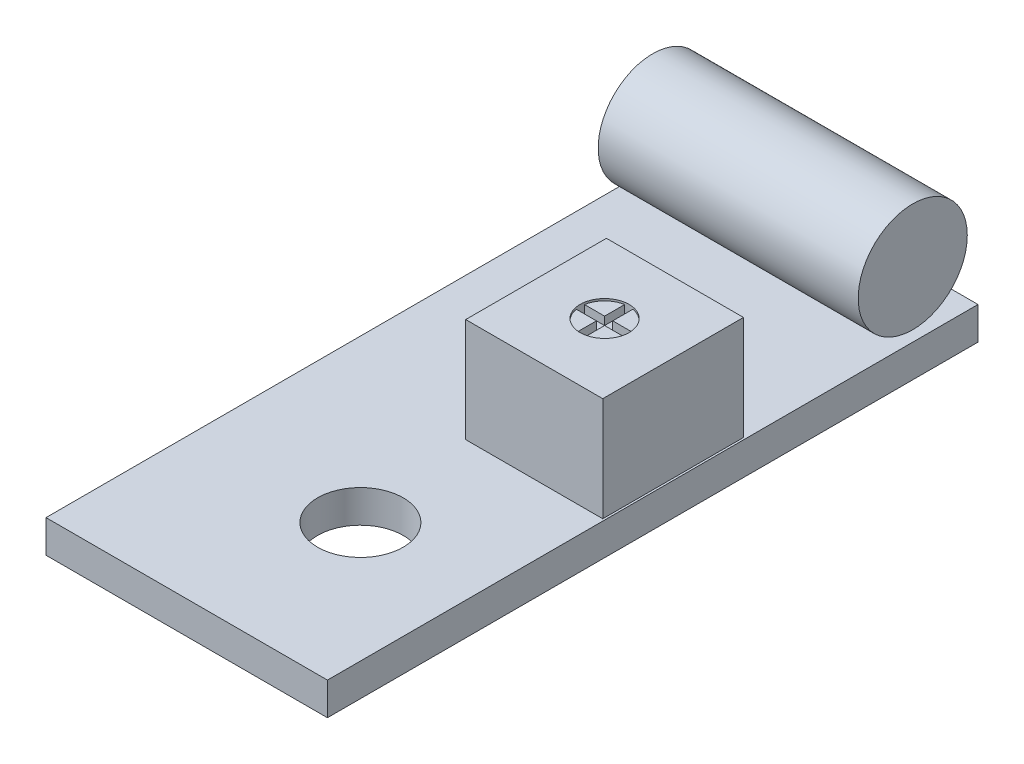
ISO-10303-21;
HEADER;
FILE_DESCRIPTION(('STEP AP214'),'2;1');
FILE_NAME('part.step','',(''),(''),'','','');
FILE_SCHEMA(('AUTOMOTIVE_DESIGN { 1 0 10303 214 1 1 1 1 }'));
ENDSEC;
DATA;
#1=APPLICATION_CONTEXT('core data for automotive mechanical design processes');
#2=APPLICATION_PROTOCOL_DEFINITION('international standard','automotive_design',2000,#1);
#3=PRODUCT_CONTEXT('',#1,'mechanical');
#4=PRODUCT('Part','Part','',(#3));
#5=PRODUCT_RELATED_PRODUCT_CATEGORY('part','',(#4));
#6=PRODUCT_DEFINITION_FORMATION('','',#4);
#7=PRODUCT_DEFINITION_CONTEXT('part definition',#1,'design');
#8=PRODUCT_DEFINITION('design','',#6,#7);
#9=PRODUCT_DEFINITION_SHAPE('','',#8);
#10=(LENGTH_UNIT() NAMED_UNIT(*) SI_UNIT(.MILLI.,.METRE.));
#11=(NAMED_UNIT(*) PLANE_ANGLE_UNIT() SI_UNIT($,.RADIAN.));
#12=(NAMED_UNIT(*) SI_UNIT($,.STERADIAN.) SOLID_ANGLE_UNIT());
#13=UNCERTAINTY_MEASURE_WITH_UNIT(LENGTH_MEASURE(1.E-05),#10,'distance_accuracy_value','');
#14=(GEOMETRIC_REPRESENTATION_CONTEXT(3) GLOBAL_UNCERTAINTY_ASSIGNED_CONTEXT((#13)) GLOBAL_UNIT_ASSIGNED_CONTEXT((#10,
#11,#12)) REPRESENTATION_CONTEXT('',''));
#15=CARTESIAN_POINT('',(0.,0.,0.));
#16=DIRECTION('',(0.,0.,1.));
#17=DIRECTION('',(1.,0.,0.));
#18=AXIS2_PLACEMENT_3D('',#15,#16,#17);
#19=CARTESIAN_POINT('',(-7.39140382901251,4.275,-13.275));
#20=DIRECTION('',(1.,0.,0.));
#21=DIRECTION('',(0.,0.,-1.));
#22=AXIS2_PLACEMENT_3D('',#19,#20,#21);
#23=CYLINDRICAL_SURFACE('',#22,2.675);
#24=CARTESIAN_POINT('',(-7.39140382901251,4.275,-13.275));
#25=DIRECTION('',(1.,0.,0.));
#26=DIRECTION('',(0.,0.,-1.));
#27=AXIS2_PLACEMENT_3D('',#24,#25,#26);
#28=CIRCLE('',#27,2.675);
#29=CARTESIAN_POINT('',(-7.39140382901251,4.275,-15.95));
#30=VERTEX_POINT('',#29);
#31=EDGE_CURVE('E12',#30,#30,#28,.T.);
#32=ORIENTED_EDGE('',*,*,#31,.T.);
#33=EDGE_LOOP('',(#32));
#34=FACE_BOUND('',#33,.T.);
#35=CARTESIAN_POINT('',(5.35859617098749,4.275,-13.275));
#36=DIRECTION('',(1.,0.,0.));
#37=DIRECTION('',(0.,0.,-1.));
#38=AXIS2_PLACEMENT_3D('',#35,#36,#37);
#39=CIRCLE('',#38,2.675);
#40=CARTESIAN_POINT('',(5.35859617098749,4.275,-15.95));
#41=VERTEX_POINT('',#40);
#42=EDGE_CURVE('E57',#41,#41,#39,.T.);
#43=ORIENTED_EDGE('',*,*,#42,.F.);
#44=EDGE_LOOP('',(#43));
#45=FACE_BOUND('',#44,.T.);
#46=ADVANCED_FACE('F51',(#34,#45),#23,.T.);
#47=CARTESIAN_POINT('',(-7.39140382901251,0.,0.));
#48=DIRECTION('',(1.,0.,0.));
#49=DIRECTION('',(0.,0.,-1.));
#50=AXIS2_PLACEMENT_3D('',#47,#48,#49);
#51=PLANE('',#50);
#52=ORIENTED_EDGE('',*,*,#31,.F.);
#53=EDGE_LOOP('',(#52));
#54=FACE_BOUND('',#53,.T.);
#55=ADVANCED_FACE('F66',(#54),#51,.F.);
#56=CARTESIAN_POINT('',(5.35859617098749,0.,0.));
#57=DIRECTION('',(1.,0.,0.));
#58=DIRECTION('',(0.,0.,-1.));
#59=AXIS2_PLACEMENT_3D('',#56,#57,#58);
#60=PLANE('',#59);
#61=ORIENTED_EDGE('',*,*,#42,.T.);
#62=EDGE_LOOP('',(#61));
#63=FACE_BOUND('',#62,.T.);
#64=ADVANCED_FACE('F63',(#63),#60,.T.);
#65=CLOSED_SHELL('',(#46,#55,#64));
#66=MANIFOLD_SOLID_BREP('B2',#65);
#67=CARTESIAN_POINT('',(0.,6.7,0.));
#68=DIRECTION('',(0.,1.,0.));
#69=DIRECTION('',(0.,0.,1.));
#70=AXIS2_PLACEMENT_3D('',#67,#68,#69);
#71=PLANE('',#70);
#72=CARTESIAN_POINT('',(2.42359617098749,6.7,-1.10000000000001));
#73=DIRECTION('',(0.,1.,0.));
#74=DIRECTION('',(0.,0.,1.));
#75=AXIS2_PLACEMENT_3D('',#72,#73,#74);
#76=CIRCLE('',#75,1.2);
#77=CARTESIAN_POINT('',(3.60681212760741,6.7,-1.30000000000001));
#78=VERTEX_POINT('',#77);
#79=CARTESIAN_POINT('',(3.61359620659932,6.7,-1.25459597421613));
#80=VERTEX_POINT('',#79);
#81=EDGE_CURVE('E302',#78,#80,#76,.T.);
#82=ORIENTED_EDGE('',*,*,#81,.F.);
#83=DIRECTION('',(-0.147775360120295,0.,-0.989020951720092));
#84=VECTOR('',#83,1.);
#85=CARTESIAN_POINT('',(3.71804696746988,6.7,-0.555534974872332));
#86=LINE('',#85,#84);
#87=EDGE_CURVE('E264',#80,#78,#86,.T.);
#88=ORIENTED_EDGE('',*,*,#87,.F.);
#89=EDGE_LOOP('',(#82,#88));
#90=FACE_BOUND('',#89,.T.);
#91=DIRECTION('',(0.,0.,1.));
#92=VECTOR('',#91,1.);
#93=CARTESIAN_POINT('',(-0.936403829012511,6.7,0.));
#94=LINE('',#93,#92);
#95=CARTESIAN_POINT('',(-0.936403829012511,6.7,-4.55000000000001));
#96=VERTEX_POINT('',#95);
#97=CARTESIAN_POINT('',(-0.93640382901251,6.7,2.34999999999999));
#98=VERTEX_POINT('',#97);
#99=EDGE_CURVE('E364',#96,#98,#94,.T.);
#100=ORIENTED_EDGE('',*,*,#99,.T.);
#101=DIRECTION('',(1.,0.,0.));
#102=VECTOR('',#101,1.);
#103=CARTESIAN_POINT('',(0.,6.7,2.34999999999999));
#104=LINE('',#103,#102);
#105=CARTESIAN_POINT('',(5.78359617098749,6.7,2.34999999999999));
#106=VERTEX_POINT('',#105);
#107=EDGE_CURVE('E367',#98,#106,#104,.T.);
#108=ORIENTED_EDGE('',*,*,#107,.T.);
#109=DIRECTION('',(0.,0.,1.));
#110=VECTOR('',#109,1.);
#111=CARTESIAN_POINT('',(5.78359617098749,6.7,0.));
#112=LINE('',#111,#110);
#113=CARTESIAN_POINT('',(5.78359617098749,6.7,-4.55000000000001));
#114=VERTEX_POINT('',#113);
#115=EDGE_CURVE('E369',#114,#106,#112,.T.);
#116=ORIENTED_EDGE('',*,*,#115,.F.);
#117=DIRECTION('',(-1.,0.,0.));
#118=VECTOR('',#117,1.);
#119=CARTESIAN_POINT('',(0.,6.7,-4.55000000000001));
#120=LINE('',#119,#118);
#121=EDGE_CURVE('E372',#114,#96,#120,.T.);
#122=ORIENTED_EDGE('',*,*,#121,.T.);
#123=EDGE_LOOP('',(#100,#108,#116,#122));
#124=FACE_BOUND('',#123,.T.);
#125=ADVANCED_FACE('F92',(#90,#124),#71,.T.);
#126=CARTESIAN_POINT('',(0.,1.6,0.));
#127=DIRECTION('',(0.,1.,0.));
#128=DIRECTION('',(0.,0.,1.));
#129=AXIS2_PLACEMENT_3D('',#126,#127,#128);
#130=PLANE('',#129);
#131=CARTESIAN_POINT('',(0.,1.6,8.44999999999999));
#132=DIRECTION('',(0.,1.,0.));
#133=DIRECTION('',(0.,0.,1.));
#134=AXIS2_PLACEMENT_3D('',#131,#132,#133);
#135=CIRCLE('',#134,2.1);
#136=CARTESIAN_POINT('',(0.,1.6,10.55));
#137=VERTEX_POINT('',#136);
#138=EDGE_CURVE('E396',#137,#137,#135,.T.);
#139=ORIENTED_EDGE('',*,*,#138,.F.);
#140=EDGE_LOOP('',(#139));
#141=FACE_BOUND('',#140,.T.);
#142=DIRECTION('',(0.,0.,1.));
#143=VECTOR('',#142,1.);
#144=CARTESIAN_POINT('',(5.88359617098749,1.6,0.));
#145=LINE('',#144,#143);
#146=CARTESIAN_POINT('',(5.88359617098749,1.6,-15.95));
#147=VERTEX_POINT('',#146);
#148=CARTESIAN_POINT('',(5.88359617098749,1.6,15.95));
#149=VERTEX_POINT('',#148);
#150=EDGE_CURVE('E402',#147,#149,#145,.T.);
#151=ORIENTED_EDGE('',*,*,#150,.F.);
#152=DIRECTION('',(1.,0.,0.));
#153=VECTOR('',#152,1.);
#154=CARTESIAN_POINT('',(0.,1.6,-15.95));
#155=LINE('',#154,#153);
#156=CARTESIAN_POINT('',(-7.91640382901251,1.6,-15.95));
#157=VERTEX_POINT('',#156);
#158=EDGE_CURVE('E404',#157,#147,#155,.T.);
#159=ORIENTED_EDGE('',*,*,#158,.F.);
#160=DIRECTION('',(0.,0.,1.));
#161=VECTOR('',#160,1.);
#162=CARTESIAN_POINT('',(-7.91640382901251,1.6,0.));
#163=LINE('',#162,#161);
#164=CARTESIAN_POINT('',(-7.91640382901251,1.6,15.95));
#165=VERTEX_POINT('',#164);
#166=EDGE_CURVE('E408',#157,#165,#163,.T.);
#167=ORIENTED_EDGE('',*,*,#166,.T.);
#168=DIRECTION('',(1.,0.,0.));
#169=VECTOR('',#168,1.);
#170=CARTESIAN_POINT('',(0.,1.6,15.95));
#171=LINE('',#170,#169);
#172=EDGE_CURVE('E116',#165,#149,#171,.T.);
#173=ORIENTED_EDGE('',*,*,#172,.T.);
#174=EDGE_LOOP('',(#151,#159,#167,#173));
#175=FACE_BOUND('',#174,.T.);
#176=DIRECTION('',(-1.,0.,0.));
#177=VECTOR('',#176,1.);
#178=CARTESIAN_POINT('',(0.,1.6,2.34999999999999));
#179=LINE('',#178,#177);
#180=CARTESIAN_POINT('',(5.78359617098749,1.6,2.34999999999999));
#181=VERTEX_POINT('',#180);
#182=CARTESIAN_POINT('',(-0.93640382901251,1.6,2.34999999999999));
#183=VERTEX_POINT('',#182);
#184=EDGE_CURVE('E389',#181,#183,#179,.T.);
#185=ORIENTED_EDGE('',*,*,#184,.T.);
#186=DIRECTION('',(0.,0.,-1.));
#187=VECTOR('',#186,1.);
#188=CARTESIAN_POINT('',(-0.936403829012511,1.6,0.));
#189=LINE('',#188,#187);
#190=CARTESIAN_POINT('',(-0.936403829012511,1.6,-4.55000000000001));
#191=VERTEX_POINT('',#190);
#192=EDGE_CURVE('E392',#183,#191,#189,.T.);
#193=ORIENTED_EDGE('',*,*,#192,.T.);
#194=DIRECTION('',(1.,0.,0.));
#195=VECTOR('',#194,1.);
#196=CARTESIAN_POINT('',(0.,1.6,-4.55000000000001));
#197=LINE('',#196,#195);
#198=CARTESIAN_POINT('',(5.78359617098749,1.6,-4.55000000000001));
#199=VERTEX_POINT('',#198);
#200=EDGE_CURVE('E384',#191,#199,#197,.T.);
#201=ORIENTED_EDGE('',*,*,#200,.T.);
#202=DIRECTION('',(0.,0.,-1.));
#203=VECTOR('',#202,1.);
#204=CARTESIAN_POINT('',(5.78359617098749,1.6,0.));
#205=LINE('',#204,#203);
#206=EDGE_CURVE('E387',#181,#199,#205,.T.);
#207=ORIENTED_EDGE('',*,*,#206,.F.);
#208=EDGE_LOOP('',(#185,#193,#201,#207));
#209=FACE_BOUND('',#208,.T.);
#210=ADVANCED_FACE('F436',(#141,#175,#209),#130,.T.);
#211=CARTESIAN_POINT('',(5.88359617098749,1.6,0.));
#212=DIRECTION('',(1.,0.,0.));
#213=DIRECTION('',(0.,0.,-1.));
#214=AXIS2_PLACEMENT_3D('',#211,#212,#213);
#215=PLANE('',#214);
#216=DIRECTION('',(0.,0.,1.));
#217=VECTOR('',#216,1.);
#218=CARTESIAN_POINT('',(5.88359617098749,0.,0.));
#219=LINE('',#218,#217);
#220=CARTESIAN_POINT('',(5.88359617098749,0.,-15.95));
#221=VERTEX_POINT('',#220);
#222=CARTESIAN_POINT('',(5.88359617098749,0.,15.95));
#223=VERTEX_POINT('',#222);
#224=EDGE_CURVE('E399',#221,#223,#219,.T.);
#225=ORIENTED_EDGE('',*,*,#224,.F.);
#226=DIRECTION('',(0.,-1.,0.));
#227=VECTOR('',#226,1.);
#228=CARTESIAN_POINT('',(5.88359617098749,1.6,-15.95));
#229=LINE('',#228,#227);
#230=EDGE_CURVE('E49',#147,#221,#229,.T.);
#231=ORIENTED_EDGE('',*,*,#230,.F.);
#232=ORIENTED_EDGE('',*,*,#150,.T.);
#233=DIRECTION('',(0.,-1.,0.));
#234=VECTOR('',#233,1.);
#235=CARTESIAN_POINT('',(5.88359617098749,1.6,15.95));
#236=LINE('',#235,#234);
#237=EDGE_CURVE('E136',#149,#223,#236,.T.);
#238=ORIENTED_EDGE('',*,*,#237,.T.);
#239=EDGE_LOOP('',(#225,#231,#232,#238));
#240=FACE_BOUND('',#239,.T.);
#241=ADVANCED_FACE('F94',(#240),#215,.T.);
#242=CARTESIAN_POINT('',(0.,1.6,-15.95));
#243=DIRECTION('',(0.,0.,-1.));
#244=DIRECTION('',(-1.,0.,0.));
#245=AXIS2_PLACEMENT_3D('',#242,#243,#244);
#246=PLANE('',#245);
#247=DIRECTION('',(1.,0.,0.));
#248=VECTOR('',#247,1.);
#249=CARTESIAN_POINT('',(0.,0.,-15.95));
#250=LINE('',#249,#248);
#251=CARTESIAN_POINT('',(-7.91640382901251,0.,-15.95));
#252=VERTEX_POINT('',#251);
#253=EDGE_CURVE('E413',#252,#221,#250,.T.);
#254=ORIENTED_EDGE('',*,*,#253,.F.);
#255=DIRECTION('',(0.,-1.,0.));
#256=VECTOR('',#255,1.);
#257=CARTESIAN_POINT('',(-7.91640382901251,1.6,-15.95));
#258=LINE('',#257,#256);
#259=EDGE_CURVE('E100',#157,#252,#258,.T.);
#260=ORIENTED_EDGE('',*,*,#259,.F.);
#261=ORIENTED_EDGE('',*,*,#158,.T.);
#262=ORIENTED_EDGE('',*,*,#230,.T.);
#263=EDGE_LOOP('',(#254,#260,#261,#262));
#264=FACE_BOUND('',#263,.T.);
#265=ADVANCED_FACE('F434',(#264),#246,.T.);
#266=CARTESIAN_POINT('',(-7.91640382901251,1.6,0.));
#267=DIRECTION('',(1.,0.,0.));
#268=DIRECTION('',(0.,0.,-1.));
#269=AXIS2_PLACEMENT_3D('',#266,#267,#268);
#270=PLANE('',#269);
#271=DIRECTION('',(0.,0.,1.));
#272=VECTOR('',#271,1.);
#273=CARTESIAN_POINT('',(-7.91640382901251,0.,0.));
#274=LINE('',#273,#272);
#275=CARTESIAN_POINT('',(-7.91640382901251,0.,15.95));
#276=VERTEX_POINT('',#275);
#277=EDGE_CURVE('E416',#252,#276,#274,.T.);
#278=ORIENTED_EDGE('',*,*,#277,.T.);
#279=DIRECTION('',(0.,-1.,0.));
#280=VECTOR('',#279,1.);
#281=CARTESIAN_POINT('',(-7.91640382901251,1.6,15.95));
#282=LINE('',#281,#280);
#283=EDGE_CURVE('E420',#165,#276,#282,.T.);
#284=ORIENTED_EDGE('',*,*,#283,.F.);
#285=ORIENTED_EDGE('',*,*,#166,.F.);
#286=ORIENTED_EDGE('',*,*,#259,.T.);
#287=EDGE_LOOP('',(#278,#284,#285,#286));
#288=FACE_BOUND('',#287,.T.);
#289=ADVANCED_FACE('F425',(#288),#270,.F.);
#290=CARTESIAN_POINT('',(0.,1.6,15.95));
#291=DIRECTION('',(0.,0.,-1.));
#292=DIRECTION('',(-1.,0.,0.));
#293=AXIS2_PLACEMENT_3D('',#290,#291,#292);
#294=PLANE('',#293);
#295=DIRECTION('',(1.,0.,0.));
#296=VECTOR('',#295,1.);
#297=CARTESIAN_POINT('',(0.,0.,15.95));
#298=LINE('',#297,#296);
#299=EDGE_CURVE('E405',#276,#223,#298,.T.);
#300=ORIENTED_EDGE('',*,*,#299,.T.);
#301=ORIENTED_EDGE('',*,*,#237,.F.);
#302=ORIENTED_EDGE('',*,*,#172,.F.);
#303=ORIENTED_EDGE('',*,*,#283,.T.);
#304=EDGE_LOOP('',(#300,#301,#302,#303));
#305=FACE_BOUND('',#304,.T.);
#306=ADVANCED_FACE('F474',(#305),#294,.F.);
#307=CARTESIAN_POINT('',(0.,0.,0.));
#308=DIRECTION('',(0.,1.,0.));
#309=DIRECTION('',(0.,0.,1.));
#310=AXIS2_PLACEMENT_3D('',#307,#308,#309);
#311=PLANE('',#310);
#312=ORIENTED_EDGE('',*,*,#224,.T.);
#313=ORIENTED_EDGE('',*,*,#299,.F.);
#314=ORIENTED_EDGE('',*,*,#277,.F.);
#315=ORIENTED_EDGE('',*,*,#253,.T.);
#316=EDGE_LOOP('',(#312,#313,#314,#315));
#317=FACE_BOUND('',#316,.T.);
#318=CARTESIAN_POINT('',(0.,0.,8.44999999999999));
#319=DIRECTION('',(0.,1.,0.));
#320=DIRECTION('',(0.,0.,1.));
#321=AXIS2_PLACEMENT_3D('',#318,#319,#320);
#322=CIRCLE('',#321,2.1);
#323=CARTESIAN_POINT('',(0.,0.,10.55));
#324=VERTEX_POINT('',#323);
#325=EDGE_CURVE('E395',#324,#324,#322,.T.);
#326=ORIENTED_EDGE('',*,*,#325,.T.);
#327=EDGE_LOOP('',(#326));
#328=FACE_BOUND('',#327,.T.);
#329=ADVANCED_FACE('F432',(#317,#328),#311,.F.);
#330=CARTESIAN_POINT('',(0.,1.6,8.44999999999999));
#331=DIRECTION('',(0.,-1.,0.));
#332=DIRECTION('',(0.,0.,-1.));
#333=AXIS2_PLACEMENT_3D('',#330,#331,#332);
#334=CYLINDRICAL_SURFACE('',#333,2.1);
#335=ORIENTED_EDGE('',*,*,#138,.T.);
#336=EDGE_LOOP('',(#335));
#337=FACE_BOUND('',#336,.T.);
#338=ORIENTED_EDGE('',*,*,#325,.F.);
#339=EDGE_LOOP('',(#338));
#340=FACE_BOUND('',#339,.T.);
#341=ADVANCED_FACE('F467',(#337,#340),#334,.F.);
#342=CARTESIAN_POINT('',(-0.936403829012511,6.7,0.));
#343=DIRECTION('',(1.,0.,0.));
#344=DIRECTION('',(0.,0.,-1.));
#345=AXIS2_PLACEMENT_3D('',#342,#343,#344);
#346=PLANE('',#345);
#347=ORIENTED_EDGE('',*,*,#192,.F.);
#348=DIRECTION('',(0.,-1.,0.));
#349=VECTOR('',#348,1.);
#350=CARTESIAN_POINT('',(-0.93640382901251,6.7,2.34999999999999));
#351=LINE('',#350,#349);
#352=EDGE_CURVE('E381',#98,#183,#351,.T.);
#353=ORIENTED_EDGE('',*,*,#352,.F.);
#354=ORIENTED_EDGE('',*,*,#99,.F.);
#355=DIRECTION('',(0.,-1.,0.));
#356=VECTOR('',#355,1.);
#357=CARTESIAN_POINT('',(-0.936403829012511,6.7,-4.55000000000001));
#358=LINE('',#357,#356);
#359=EDGE_CURVE('E374',#96,#191,#358,.T.);
#360=ORIENTED_EDGE('',*,*,#359,.T.);
#361=EDGE_LOOP('',(#347,#353,#354,#360));
#362=FACE_BOUND('',#361,.T.);
#363=ADVANCED_FACE('F463',(#362),#346,.F.);
#364=CARTESIAN_POINT('',(0.,6.7,2.34999999999999));
#365=DIRECTION('',(0.,0.,-1.));
#366=DIRECTION('',(-1.,0.,0.));
#367=AXIS2_PLACEMENT_3D('',#364,#365,#366);
#368=PLANE('',#367);
#369=ORIENTED_EDGE('',*,*,#184,.F.);
#370=DIRECTION('',(0.,-1.,0.));
#371=VECTOR('',#370,1.);
#372=CARTESIAN_POINT('',(5.78359617098749,6.7,2.34999999999999));
#373=LINE('',#372,#371);
#374=EDGE_CURVE('E378',#106,#181,#373,.T.);
#375=ORIENTED_EDGE('',*,*,#374,.F.);
#376=ORIENTED_EDGE('',*,*,#107,.F.);
#377=ORIENTED_EDGE('',*,*,#352,.T.);
#378=EDGE_LOOP('',(#369,#375,#376,#377));
#379=FACE_BOUND('',#378,.T.);
#380=ADVANCED_FACE('F459',(#379),#368,.F.);
#381=CARTESIAN_POINT('',(5.78359617098749,6.7,0.));
#382=DIRECTION('',(1.,0.,0.));
#383=DIRECTION('',(0.,0.,-1.));
#384=AXIS2_PLACEMENT_3D('',#381,#382,#383);
#385=PLANE('',#384);
#386=ORIENTED_EDGE('',*,*,#374,.T.);
#387=ORIENTED_EDGE('',*,*,#206,.T.);
#388=DIRECTION('',(0.,-1.,0.));
#389=VECTOR('',#388,1.);
#390=CARTESIAN_POINT('',(5.78359617098749,6.7,-4.55000000000001));
#391=LINE('',#390,#389);
#392=EDGE_CURVE('E107',#114,#199,#391,.T.);
#393=ORIENTED_EDGE('',*,*,#392,.F.);
#394=ORIENTED_EDGE('',*,*,#115,.T.);
#395=EDGE_LOOP('',(#386,#387,#393,#394));
#396=FACE_BOUND('',#395,.T.);
#397=ADVANCED_FACE('F456',(#396),#385,.T.);
#398=CARTESIAN_POINT('',(0.,6.7,-4.55000000000001));
#399=DIRECTION('',(0.,0.,1.));
#400=DIRECTION('',(1.,0.,0.));
#401=AXIS2_PLACEMENT_3D('',#398,#399,#400);
#402=PLANE('',#401);
#403=ORIENTED_EDGE('',*,*,#200,.F.);
#404=ORIENTED_EDGE('',*,*,#359,.F.);
#405=ORIENTED_EDGE('',*,*,#121,.F.);
#406=ORIENTED_EDGE('',*,*,#392,.T.);
#407=EDGE_LOOP('',(#403,#404,#405,#406));
#408=FACE_BOUND('',#407,.T.);
#409=ADVANCED_FACE('F453',(#408),#402,.F.);
#410=CARTESIAN_POINT('',(0.,6.6,0.));
#411=DIRECTION('',(0.,1.,0.));
#412=DIRECTION('',(0.,0.,1.));
#413=AXIS2_PLACEMENT_3D('',#410,#411,#412);
#414=PLANE('',#413);
#415=DIRECTION('',(-1.,0.,0.));
#416=VECTOR('',#415,1.);
#417=CARTESIAN_POINT('',(0.,6.6,-1.30000000000001));
#418=LINE('',#417,#416);
#419=CARTESIAN_POINT('',(3.60681212760741,6.6,-1.30000000000001));
#420=VERTEX_POINT('',#419);
#421=CARTESIAN_POINT('',(2.62359617098749,6.6,-1.30000000000001));
#422=VERTEX_POINT('',#421);
#423=EDGE_CURVE('E339',#420,#422,#418,.T.);
#424=ORIENTED_EDGE('',*,*,#423,.F.);
#425=CARTESIAN_POINT('',(2.42359617098749,6.6,-1.10000000000001));
#426=DIRECTION('',(0.,1.,0.));
#427=DIRECTION('',(0.,0.,1.));
#428=AXIS2_PLACEMENT_3D('',#425,#426,#427);
#429=CIRCLE('',#428,1.2);
#430=CARTESIAN_POINT('',(2.62359617098749,6.6,-2.28321595661993));
#431=VERTEX_POINT('',#430);
#432=EDGE_CURVE('E355',#420,#431,#429,.T.);
#433=ORIENTED_EDGE('',*,*,#432,.T.);
#434=DIRECTION('',(0.,0.,1.));
#435=VECTOR('',#434,1.);
#436=CARTESIAN_POINT('',(2.62359617098749,6.6,0.));
#437=LINE('',#436,#435);
#438=EDGE_CURVE('E358',#431,#422,#437,.T.);
#439=ORIENTED_EDGE('',*,*,#438,.T.);
#440=EDGE_LOOP('',(#424,#433,#439));
#441=FACE_BOUND('',#440,.T.);
#442=ADVANCED_FACE('F451',(#441),#414,.T.);
#443=CARTESIAN_POINT('',(0.,6.6,0.));
#444=DIRECTION('',(0.,1.,0.));
#445=DIRECTION('',(0.,0.,1.));
#446=AXIS2_PLACEMENT_3D('',#443,#444,#445);
#447=PLANE('',#446);
#448=DIRECTION('',(0.,0.,1.));
#449=VECTOR('',#448,1.);
#450=CARTESIAN_POINT('',(2.22359617098749,6.6,0.));
#451=LINE('',#450,#449);
#452=CARTESIAN_POINT('',(2.22359617098749,6.6,-2.28321595661993));
#453=VERTEX_POINT('',#452);
#454=CARTESIAN_POINT('',(2.22359617098749,6.6,-1.30000000000001));
#455=VERTEX_POINT('',#454);
#456=EDGE_CURVE('E331',#453,#455,#451,.T.);
#457=ORIENTED_EDGE('',*,*,#456,.F.);
#458=CARTESIAN_POINT('',(2.42359617098749,6.6,-1.10000000000001));
#459=DIRECTION('',(0.,1.,0.));
#460=DIRECTION('',(0.,0.,1.));
#461=AXIS2_PLACEMENT_3D('',#458,#459,#460);
#462=CIRCLE('',#461,1.2);
#463=CARTESIAN_POINT('',(1.24038021436757,6.6,-1.30000000000001));
#464=VERTEX_POINT('',#463);
#465=EDGE_CURVE('E333',#453,#464,#462,.T.);
#466=ORIENTED_EDGE('',*,*,#465,.T.);
#467=DIRECTION('',(-1.,0.,0.));
#468=VECTOR('',#467,1.);
#469=CARTESIAN_POINT('',(0.,6.6,-1.30000000000001));
#470=LINE('',#469,#468);
#471=EDGE_CURVE('E337',#455,#464,#470,.T.);
#472=ORIENTED_EDGE('',*,*,#471,.F.);
#473=EDGE_LOOP('',(#457,#466,#472));
#474=FACE_BOUND('',#473,.T.);
#475=ADVANCED_FACE('F518',(#474),#447,.T.);
#476=CARTESIAN_POINT('',(0.,6.6,0.));
#477=DIRECTION('',(0.,1.,0.));
#478=DIRECTION('',(0.,0.,1.));
#479=AXIS2_PLACEMENT_3D('',#476,#477,#478);
#480=PLANE('',#479);
#481=DIRECTION('',(-1.,0.,0.));
#482=VECTOR('',#481,1.);
#483=CARTESIAN_POINT('',(0.,6.6,-0.900000000000007));
#484=LINE('',#483,#482);
#485=CARTESIAN_POINT('',(2.22359617098749,6.6,-0.900000000000007));
#486=VERTEX_POINT('',#485);
#487=CARTESIAN_POINT('',(1.24038021436757,6.6,-0.900000000000007));
#488=VERTEX_POINT('',#487);
#489=EDGE_CURVE('E340',#486,#488,#484,.T.);
#490=ORIENTED_EDGE('',*,*,#489,.T.);
#491=CARTESIAN_POINT('',(2.42359617098749,6.6,-1.10000000000001));
#492=DIRECTION('',(0.,1.,0.));
#493=DIRECTION('',(0.,0.,1.));
#494=AXIS2_PLACEMENT_3D('',#491,#492,#493);
#495=CIRCLE('',#494,1.2);
#496=CARTESIAN_POINT('',(2.22359617098749,6.6,0.0832159566199163));
#497=VERTEX_POINT('',#496);
#498=EDGE_CURVE('E343',#488,#497,#495,.T.);
#499=ORIENTED_EDGE('',*,*,#498,.T.);
#500=DIRECTION('',(0.,0.,1.));
#501=VECTOR('',#500,1.);
#502=CARTESIAN_POINT('',(2.22359617098749,6.6,0.));
#503=LINE('',#502,#501);
#504=EDGE_CURVE('E334',#486,#497,#503,.T.);
#505=ORIENTED_EDGE('',*,*,#504,.F.);
#506=EDGE_LOOP('',(#490,#499,#505));
#507=FACE_BOUND('',#506,.T.);
#508=ADVANCED_FACE('F525',(#507),#480,.T.);
#509=CARTESIAN_POINT('',(2.42359617098749,6.6,-1.10000000000001));
#510=DIRECTION('',(0.,1.,0.));
#511=DIRECTION('',(0.,0.,1.));
#512=AXIS2_PLACEMENT_3D('',#509,#510,#511);
#513=CYLINDRICAL_SURFACE('',#512,1.2);
#514=ORIENTED_EDGE('',*,*,#81,.T.);
#515=DIRECTION('',(0.,1.,0.));
#516=VECTOR('',#515,1.);
#517=CARTESIAN_POINT('',(3.61359620659932,6.2,-1.25459597421613));
#518=LINE('',#517,#516);
#519=CARTESIAN_POINT('',(3.61359620659932,6.2,-1.25459597421613));
#520=VERTEX_POINT('',#519);
#521=EDGE_CURVE('E255',#520,#80,#518,.T.);
#522=ORIENTED_EDGE('',*,*,#521,.F.);
#523=CARTESIAN_POINT('',(2.42359617098749,6.2,-1.10000000000001));
#524=DIRECTION('',(0.,1.,0.));
#525=DIRECTION('',(0.,0.,1.));
#526=AXIS2_PLACEMENT_3D('',#523,#524,#525);
#527=CIRCLE('',#526,1.2);
#528=CARTESIAN_POINT('',(3.60681212760741,6.2,-0.900000000000007));
#529=VERTEX_POINT('',#528);
#530=EDGE_CURVE('E262',#529,#520,#527,.T.);
#531=ORIENTED_EDGE('',*,*,#530,.F.);
#532=DIRECTION('',(0.,1.,0.));
#533=VECTOR('',#532,1.);
#534=CARTESIAN_POINT('',(3.60681212760741,6.2,-0.900000000000007));
#535=LINE('',#534,#533);
#536=CARTESIAN_POINT('',(3.60681212760741,6.6,-0.900000000000007));
#537=VERTEX_POINT('',#536);
#538=EDGE_CURVE('E243',#529,#537,#535,.T.);
#539=ORIENTED_EDGE('',*,*,#538,.T.);
#540=CARTESIAN_POINT('',(2.42359617098749,6.6,-1.10000000000001));
#541=DIRECTION('',(0.,1.,0.));
#542=DIRECTION('',(0.,0.,1.));
#543=AXIS2_PLACEMENT_3D('',#540,#541,#542);
#544=CIRCLE('',#543,1.2);
#545=CARTESIAN_POINT('',(2.62359617098749,6.6,0.0832159566199163));
#546=VERTEX_POINT('',#545);
#547=EDGE_CURVE('E350',#546,#537,#544,.T.);
#548=ORIENTED_EDGE('',*,*,#547,.F.);
#549=DIRECTION('',(0.,1.,0.));
#550=VECTOR('',#549,1.);
#551=CARTESIAN_POINT('',(2.62359617098749,6.2,0.0832159566199163));
#552=LINE('',#551,#550);
#553=CARTESIAN_POINT('',(2.62359617098749,6.2,0.0832159566199163));
#554=VERTEX_POINT('',#553);
#555=EDGE_CURVE('E303',#554,#546,#552,.T.);
#556=ORIENTED_EDGE('',*,*,#555,.F.);
#557=CARTESIAN_POINT('',(2.22359617098749,6.2,0.0832159566199163));
#558=VERTEX_POINT('',#557);
#559=EDGE_CURVE('E271',#558,#554,#527,.T.);
#560=ORIENTED_EDGE('',*,*,#559,.F.);
#561=DIRECTION('',(0.,1.,0.));
#562=VECTOR('',#561,1.);
#563=CARTESIAN_POINT('',(2.22359617098749,6.2,0.0832159566199163));
#564=LINE('',#563,#562);
#565=EDGE_CURVE('E305',#558,#497,#564,.T.);
#566=ORIENTED_EDGE('',*,*,#565,.T.);
#567=ORIENTED_EDGE('',*,*,#498,.F.);
#568=DIRECTION('',(0.,1.,0.));
#569=VECTOR('',#568,1.);
#570=CARTESIAN_POINT('',(1.24038021436757,6.2,-0.900000000000007));
#571=LINE('',#570,#569);
#572=CARTESIAN_POINT('',(1.24038021436757,6.2,-0.900000000000007));
#573=VERTEX_POINT('',#572);
#574=EDGE_CURVE('E311',#573,#488,#571,.T.);
#575=ORIENTED_EDGE('',*,*,#574,.F.);
#576=CARTESIAN_POINT('',(1.24038021436757,6.2,-1.30000000000001));
#577=VERTEX_POINT('',#576);
#578=EDGE_CURVE('E276',#577,#573,#527,.T.);
#579=ORIENTED_EDGE('',*,*,#578,.F.);
#580=DIRECTION('',(0.,1.,0.));
#581=VECTOR('',#580,1.);
#582=CARTESIAN_POINT('',(1.24038021436757,6.2,-1.30000000000001));
#583=LINE('',#582,#581);
#584=EDGE_CURVE('E313',#577,#464,#583,.T.);
#585=ORIENTED_EDGE('',*,*,#584,.T.);
#586=ORIENTED_EDGE('',*,*,#465,.F.);
#587=DIRECTION('',(0.,1.,0.));
#588=VECTOR('',#587,1.);
#589=CARTESIAN_POINT('',(2.22359617098749,6.2,-2.28321595661993));
#590=LINE('',#589,#588);
#591=CARTESIAN_POINT('',(2.22359617098749,6.2,-2.28321595661993));
#592=VERTEX_POINT('',#591);
#593=EDGE_CURVE('E319',#592,#453,#590,.T.);
#594=ORIENTED_EDGE('',*,*,#593,.F.);
#595=CARTESIAN_POINT('',(2.62359617098749,6.2,-2.28321595661993));
#596=VERTEX_POINT('',#595);
#597=EDGE_CURVE('E272',#596,#592,#527,.T.);
#598=ORIENTED_EDGE('',*,*,#597,.F.);
#599=DIRECTION('',(0.,1.,0.));
#600=VECTOR('',#599,1.);
#601=CARTESIAN_POINT('',(2.62359617098749,6.2,-2.28321595661993));
#602=LINE('',#601,#600);
#603=EDGE_CURVE('E321',#596,#431,#602,.T.);
#604=ORIENTED_EDGE('',*,*,#603,.T.);
#605=ORIENTED_EDGE('',*,*,#432,.F.);
#606=DIRECTION('',(0.,1.,0.));
#607=VECTOR('',#606,1.);
#608=CARTESIAN_POINT('',(3.60681212760741,6.6,-1.30000000000001));
#609=LINE('',#608,#607);
#610=EDGE_CURVE('E361',#420,#78,#609,.T.);
#611=ORIENTED_EDGE('',*,*,#610,.T.);
#612=EDGE_LOOP('',(#514,#522,#531,#539,#548,#556,#560,#566,#567,#575,#579,#585,#586,#594,#598,
#604,#605,#611));
#613=FACE_BOUND('',#612,.T.);
#614=ADVANCED_FACE('F266',(#613),#513,.F.);
#615=CARTESIAN_POINT('',(0.,6.6,0.));
#616=DIRECTION('',(0.,1.,0.));
#617=DIRECTION('',(0.,0.,1.));
#618=AXIS2_PLACEMENT_3D('',#615,#616,#617);
#619=PLANE('',#618);
#620=DIRECTION('',(0.,0.,1.));
#621=VECTOR('',#620,1.);
#622=CARTESIAN_POINT('',(2.62359617098749,6.6,0.));
#623=LINE('',#622,#621);
#624=CARTESIAN_POINT('',(2.62359617098749,6.6,-0.900000000000007));
#625=VERTEX_POINT('',#624);
#626=EDGE_CURVE('E347',#625,#546,#623,.T.);
#627=ORIENTED_EDGE('',*,*,#626,.T.);
#628=ORIENTED_EDGE('',*,*,#547,.T.);
#629=DIRECTION('',(-1.,0.,0.));
#630=VECTOR('',#629,1.);
#631=CARTESIAN_POINT('',(0.,6.6,-0.900000000000008));
#632=LINE('',#631,#630);
#633=EDGE_CURVE('E250',#537,#625,#632,.T.);
#634=ORIENTED_EDGE('',*,*,#633,.T.);
#635=EDGE_LOOP('',(#627,#628,#634));
#636=FACE_BOUND('',#635,.T.);
#637=ADVANCED_FACE('F540',(#636),#619,.T.);
#638=CARTESIAN_POINT('',(0.,6.2,-0.900000000000008));
#639=DIRECTION('',(0.,0.,-1.));
#640=DIRECTION('',(-1.,0.,0.));
#641=AXIS2_PLACEMENT_3D('',#638,#639,#640);
#642=PLANE('',#641);
#643=ORIENTED_EDGE('',*,*,#538,.F.);
#644=DIRECTION('',(-1.,0.,0.));
#645=VECTOR('',#644,1.);
#646=CARTESIAN_POINT('',(0.,6.2,-0.900000000000008));
#647=LINE('',#646,#645);
#648=CARTESIAN_POINT('',(2.62359617098749,6.2,-0.900000000000007));
#649=VERTEX_POINT('',#648);
#650=EDGE_CURVE('E247',#529,#649,#647,.T.);
#651=ORIENTED_EDGE('',*,*,#650,.T.);
#652=DIRECTION('',(0.,1.,0.));
#653=VECTOR('',#652,1.);
#654=CARTESIAN_POINT('',(2.62359617098749,6.2,-0.900000000000007));
#655=LINE('',#654,#653);
#656=EDGE_CURVE('E300',#649,#625,#655,.T.);
#657=ORIENTED_EDGE('',*,*,#656,.T.);
#658=ORIENTED_EDGE('',*,*,#633,.F.);
#659=EDGE_LOOP('',(#643,#651,#657,#658));
#660=FACE_BOUND('',#659,.T.);
#661=ADVANCED_FACE('F245',(#660),#642,.T.);
#662=CARTESIAN_POINT('',(2.62359617098749,6.2,0.));
#663=DIRECTION('',(-1.,0.,0.));
#664=DIRECTION('',(0.,0.,1.));
#665=AXIS2_PLACEMENT_3D('',#662,#663,#664);
#666=PLANE('',#665);
#667=ORIENTED_EDGE('',*,*,#656,.F.);
#668=DIRECTION('',(0.,0.,1.));
#669=VECTOR('',#668,1.);
#670=CARTESIAN_POINT('',(2.62359617098749,6.2,0.));
#671=LINE('',#670,#669);
#672=EDGE_CURVE('E256',#649,#554,#671,.T.);
#673=ORIENTED_EDGE('',*,*,#672,.T.);
#674=ORIENTED_EDGE('',*,*,#555,.T.);
#675=ORIENTED_EDGE('',*,*,#626,.F.);
#676=EDGE_LOOP('',(#667,#673,#674,#675));
#677=FACE_BOUND('',#676,.T.);
#678=ADVANCED_FACE('F553',(#677),#666,.T.);
#679=CARTESIAN_POINT('',(2.22359617098749,6.2,0.));
#680=DIRECTION('',(-1.,0.,0.));
#681=DIRECTION('',(0.,0.,1.));
#682=AXIS2_PLACEMENT_3D('',#679,#680,#681);
#683=PLANE('',#682);
#684=ORIENTED_EDGE('',*,*,#504,.T.);
#685=ORIENTED_EDGE('',*,*,#565,.F.);
#686=DIRECTION('',(0.,0.,1.));
#687=VECTOR('',#686,1.);
#688=CARTESIAN_POINT('',(2.22359617098749,6.2,0.));
#689=LINE('',#688,#687);
#690=CARTESIAN_POINT('',(2.22359617098749,6.2,-0.900000000000007));
#691=VERTEX_POINT('',#690);
#692=EDGE_CURVE('E275',#691,#558,#689,.T.);
#693=ORIENTED_EDGE('',*,*,#692,.F.);
#694=DIRECTION('',(0.,1.,0.));
#695=VECTOR('',#694,1.);
#696=CARTESIAN_POINT('',(2.22359617098749,6.2,-0.900000000000007));
#697=LINE('',#696,#695);
#698=EDGE_CURVE('E308',#691,#486,#697,.T.);
#699=ORIENTED_EDGE('',*,*,#698,.T.);
#700=EDGE_LOOP('',(#684,#685,#693,#699));
#701=FACE_BOUND('',#700,.T.);
#702=ADVANCED_FACE('F560',(#701),#683,.F.);
#703=CARTESIAN_POINT('',(0.,6.2,-0.900000000000007));
#704=DIRECTION('',(0.,0.,-1.));
#705=DIRECTION('',(-1.,0.,0.));
#706=AXIS2_PLACEMENT_3D('',#703,#704,#705);
#707=PLANE('',#706);
#708=ORIENTED_EDGE('',*,*,#698,.F.);
#709=DIRECTION('',(-1.,0.,0.));
#710=VECTOR('',#709,1.);
#711=CARTESIAN_POINT('',(0.,6.2,-0.900000000000007));
#712=LINE('',#711,#710);
#713=EDGE_CURVE('E287',#691,#573,#712,.T.);
#714=ORIENTED_EDGE('',*,*,#713,.T.);
#715=ORIENTED_EDGE('',*,*,#574,.T.);
#716=ORIENTED_EDGE('',*,*,#489,.F.);
#717=EDGE_LOOP('',(#708,#714,#715,#716));
#718=FACE_BOUND('',#717,.T.);
#719=ADVANCED_FACE('F568',(#718),#707,.T.);
#720=CARTESIAN_POINT('',(0.,6.2,-1.30000000000001));
#721=DIRECTION('',(0.,0.,-1.));
#722=DIRECTION('',(-1.,0.,0.));
#723=AXIS2_PLACEMENT_3D('',#720,#721,#722);
#724=PLANE('',#723);
#725=ORIENTED_EDGE('',*,*,#471,.T.);
#726=ORIENTED_EDGE('',*,*,#584,.F.);
#727=DIRECTION('',(-1.,0.,0.));
#728=VECTOR('',#727,1.);
#729=CARTESIAN_POINT('',(0.,6.2,-1.30000000000001));
#730=LINE('',#729,#728);
#731=CARTESIAN_POINT('',(2.22359617098749,6.2,-1.30000000000001));
#732=VERTEX_POINT('',#731);
#733=EDGE_CURVE('E283',#732,#577,#730,.T.);
#734=ORIENTED_EDGE('',*,*,#733,.F.);
#735=DIRECTION('',(0.,1.,0.));
#736=VECTOR('',#735,1.);
#737=CARTESIAN_POINT('',(2.22359617098749,6.2,-1.30000000000001));
#738=LINE('',#737,#736);
#739=EDGE_CURVE('E316',#732,#455,#738,.T.);
#740=ORIENTED_EDGE('',*,*,#739,.T.);
#741=EDGE_LOOP('',(#725,#726,#734,#740));
#742=FACE_BOUND('',#741,.T.);
#743=ADVANCED_FACE('F576',(#742),#724,.F.);
#744=CARTESIAN_POINT('',(2.22359617098749,6.2,0.));
#745=DIRECTION('',(-1.,0.,0.));
#746=DIRECTION('',(0.,0.,1.));
#747=AXIS2_PLACEMENT_3D('',#744,#745,#746);
#748=PLANE('',#747);
#749=ORIENTED_EDGE('',*,*,#456,.T.);
#750=ORIENTED_EDGE('',*,*,#739,.F.);
#751=DIRECTION('',(0.,0.,1.));
#752=VECTOR('',#751,1.);
#753=CARTESIAN_POINT('',(2.22359617098749,6.2,0.));
#754=LINE('',#753,#752);
#755=EDGE_CURVE('E278',#592,#732,#754,.T.);
#756=ORIENTED_EDGE('',*,*,#755,.F.);
#757=ORIENTED_EDGE('',*,*,#593,.T.);
#758=EDGE_LOOP('',(#749,#750,#756,#757));
#759=FACE_BOUND('',#758,.T.);
#760=ADVANCED_FACE('F584',(#759),#748,.F.);
#761=CARTESIAN_POINT('',(2.62359617098749,6.2,0.));
#762=DIRECTION('',(-1.,0.,0.));
#763=DIRECTION('',(0.,0.,1.));
#764=AXIS2_PLACEMENT_3D('',#761,#762,#763);
#765=PLANE('',#764);
#766=ORIENTED_EDGE('',*,*,#603,.F.);
#767=DIRECTION('',(0.,0.,1.));
#768=VECTOR('',#767,1.);
#769=CARTESIAN_POINT('',(2.62359617098749,6.2,0.));
#770=LINE('',#769,#768);
#771=CARTESIAN_POINT('',(2.62359617098749,6.2,-1.30000000000001));
#772=VERTEX_POINT('',#771);
#773=EDGE_CURVE('E279',#596,#772,#770,.T.);
#774=ORIENTED_EDGE('',*,*,#773,.T.);
#775=DIRECTION('',(0.,1.,0.));
#776=VECTOR('',#775,1.);
#777=CARTESIAN_POINT('',(2.62359617098749,6.2,-1.30000000000001));
#778=LINE('',#777,#776);
#779=EDGE_CURVE('E324',#772,#422,#778,.T.);
#780=ORIENTED_EDGE('',*,*,#779,.T.);
#781=ORIENTED_EDGE('',*,*,#438,.F.);
#782=EDGE_LOOP('',(#766,#774,#780,#781));
#783=FACE_BOUND('',#782,.T.);
#784=ADVANCED_FACE('F592',(#783),#765,.T.);
#785=CARTESIAN_POINT('',(0.,6.2,-1.30000000000001));
#786=DIRECTION('',(0.,0.,-1.));
#787=DIRECTION('',(-1.,0.,0.));
#788=AXIS2_PLACEMENT_3D('',#785,#786,#787);
#789=PLANE('',#788);
#790=ORIENTED_EDGE('',*,*,#423,.T.);
#791=ORIENTED_EDGE('',*,*,#779,.F.);
#792=DIRECTION('',(-1.,0.,0.));
#793=VECTOR('',#792,1.);
#794=CARTESIAN_POINT('',(0.,6.2,-1.30000000000001));
#795=LINE('',#794,#793);
#796=CARTESIAN_POINT('',(3.60681212760741,6.2,-1.30000000000001));
#797=VERTEX_POINT('',#796);
#798=EDGE_CURVE('E273',#797,#772,#795,.T.);
#799=ORIENTED_EDGE('',*,*,#798,.F.);
#800=DIRECTION('',(0.,1.,0.));
#801=VECTOR('',#800,1.);
#802=CARTESIAN_POINT('',(3.60681212760741,6.2,-1.30000000000001));
#803=LINE('',#802,#801);
#804=EDGE_CURVE('E327',#797,#420,#803,.T.);
#805=ORIENTED_EDGE('',*,*,#804,.T.);
#806=EDGE_LOOP('',(#790,#791,#799,#805));
#807=FACE_BOUND('',#806,.T.);
#808=ADVANCED_FACE('F600',(#807),#789,.F.);
#809=CARTESIAN_POINT('',(3.71804696746988,6.2,-0.555534974872332));
#810=DIRECTION('',(0.989020951720092,0.,-0.147775360120295));
#811=DIRECTION('',(-0.147775360120295,0.,-0.989020951720092));
#812=AXIS2_PLACEMENT_3D('',#809,#810,#811);
#813=PLANE('',#812);
#814=ORIENTED_EDGE('',*,*,#87,.T.);
#815=ORIENTED_EDGE('',*,*,#610,.F.);
#816=ORIENTED_EDGE('',*,*,#804,.F.);
#817=DIRECTION('',(-0.147775360120295,0.,-0.989020951720092));
#818=VECTOR('',#817,1.);
#819=CARTESIAN_POINT('',(3.71804696746988,6.2,-0.555534974872332));
#820=LINE('',#819,#818);
#821=EDGE_CURVE('E269',#520,#797,#820,.T.);
#822=ORIENTED_EDGE('',*,*,#821,.F.);
#823=ORIENTED_EDGE('',*,*,#521,.T.);
#824=EDGE_LOOP('',(#814,#815,#816,#822,#823));
#825=FACE_BOUND('',#824,.T.);
#826=ADVANCED_FACE('F608',(#825),#813,.F.);
#827=CARTESIAN_POINT('',(0.,6.2,0.));
#828=DIRECTION('',(0.,1.,0.));
#829=DIRECTION('',(0.,0.,1.));
#830=AXIS2_PLACEMENT_3D('',#827,#828,#829);
#831=PLANE('',#830);
#832=ORIENTED_EDGE('',*,*,#650,.F.);
#833=ORIENTED_EDGE('',*,*,#530,.T.);
#834=ORIENTED_EDGE('',*,*,#821,.T.);
#835=ORIENTED_EDGE('',*,*,#798,.T.);
#836=ORIENTED_EDGE('',*,*,#773,.F.);
#837=ORIENTED_EDGE('',*,*,#597,.T.);
#838=ORIENTED_EDGE('',*,*,#755,.T.);
#839=ORIENTED_EDGE('',*,*,#733,.T.);
#840=ORIENTED_EDGE('',*,*,#578,.T.);
#841=ORIENTED_EDGE('',*,*,#713,.F.);
#842=ORIENTED_EDGE('',*,*,#692,.T.);
#843=ORIENTED_EDGE('',*,*,#559,.T.);
#844=ORIENTED_EDGE('',*,*,#672,.F.);
#845=EDGE_LOOP('',(#832,#833,#834,#835,#836,#837,#838,#839,#840,#841,#842,#843,#844));
#846=FACE_BOUND('',#845,.T.);
#847=ADVANCED_FACE('F260',(#846),#831,.T.);
#848=CLOSED_SHELL('',(#125,#210,#241,#265,#289,#306,#329,#341,#363,#380,#397,#409,#442,#475,
#508,#614,#637,#661,#678,#702,#719,#743,#760,#784,#808,#826,#847));
#849=MANIFOLD_SOLID_BREP('B7',#848);
#850=ADVANCED_BREP_SHAPE_REPRESENTATION('',(#18,#66,#849),#14);
#851=SHAPE_DEFINITION_REPRESENTATION(#9,#850);
ENDSEC;
END-ISO-10303-21;
